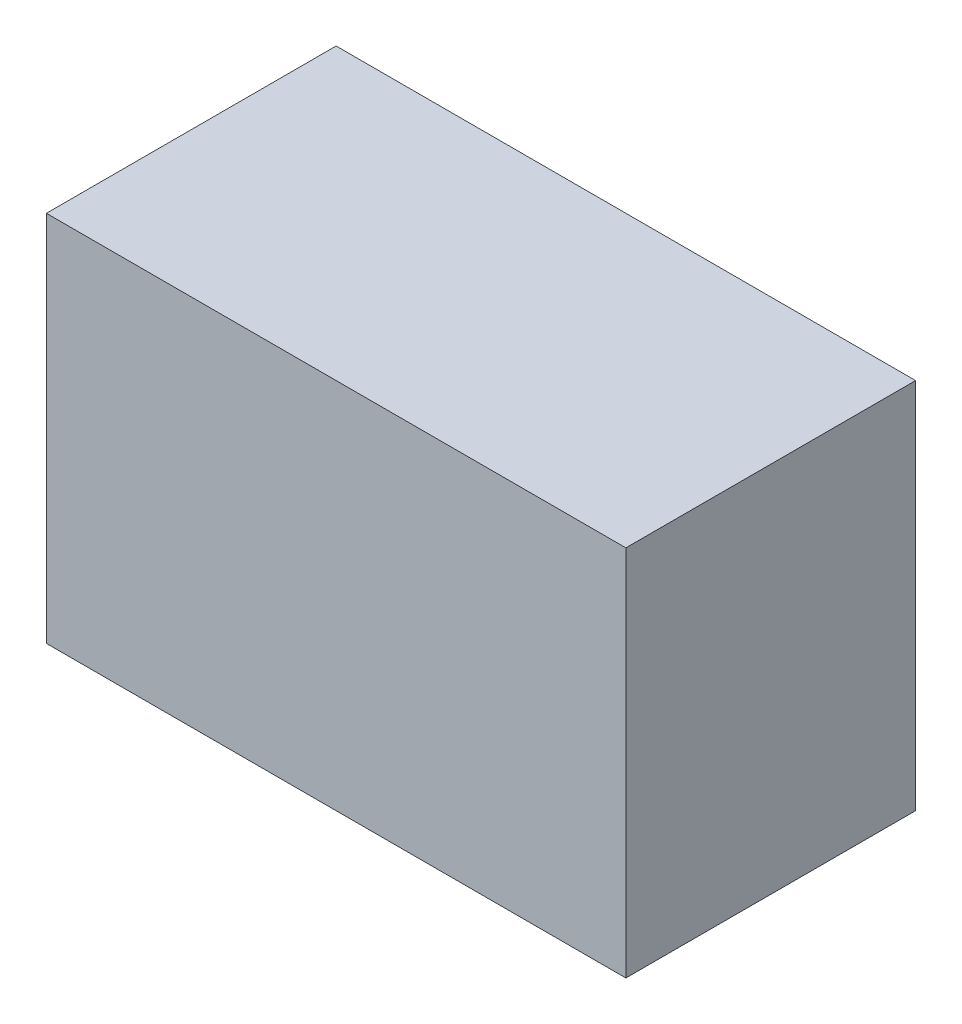
ISO-10303-21;
HEADER;
FILE_DESCRIPTION(('STEP AP214'),'2;1');
FILE_NAME('part.step','',(''),(''),'','','');
FILE_SCHEMA(('AUTOMOTIVE_DESIGN { 1 0 10303 214 1 1 1 1 }'));
ENDSEC;
DATA;
#1=APPLICATION_CONTEXT('core data for automotive mechanical design processes');
#2=APPLICATION_PROTOCOL_DEFINITION('international standard','automotive_design',2000,#1);
#3=PRODUCT_CONTEXT('',#1,'mechanical');
#4=PRODUCT('Part','Part','',(#3));
#5=PRODUCT_RELATED_PRODUCT_CATEGORY('part','',(#4));
#6=PRODUCT_DEFINITION_FORMATION('','',#4);
#7=PRODUCT_DEFINITION_CONTEXT('part definition',#1,'design');
#8=PRODUCT_DEFINITION('design','',#6,#7);
#9=PRODUCT_DEFINITION_SHAPE('','',#8);
#10=(LENGTH_UNIT() NAMED_UNIT(*) SI_UNIT(.MILLI.,.METRE.));
#11=(NAMED_UNIT(*) PLANE_ANGLE_UNIT() SI_UNIT($,.RADIAN.));
#12=(NAMED_UNIT(*) SI_UNIT($,.STERADIAN.) SOLID_ANGLE_UNIT());
#13=UNCERTAINTY_MEASURE_WITH_UNIT(LENGTH_MEASURE(1.E-05),#10,'distance_accuracy_value','');
#14=(GEOMETRIC_REPRESENTATION_CONTEXT(3) GLOBAL_UNCERTAINTY_ASSIGNED_CONTEXT((#13)) GLOBAL_UNIT_ASSIGNED_CONTEXT((#10,
#11,#12)) REPRESENTATION_CONTEXT('',''));
#15=CARTESIAN_POINT('',(0.,0.,0.));
#16=DIRECTION('',(0.,0.,1.));
#17=DIRECTION('',(1.,0.,0.));
#18=AXIS2_PLACEMENT_3D('',#15,#16,#17);
#19=CARTESIAN_POINT('',(-700.,-900.,-350.));
#20=DIRECTION('',(-1.,0.,0.));
#21=DIRECTION('',(0.,0.,1.));
#22=AXIS2_PLACEMENT_3D('',#19,#20,#21);
#23=PLANE('',#22);
#24=DIRECTION('',(0.,0.,1.));
#25=VECTOR('',#24,1.);
#26=CARTESIAN_POINT('',(-700.,0.,-350.));
#27=LINE('',#26,#25);
#28=CARTESIAN_POINT('',(-700.,0.,-350.));
#29=VERTEX_POINT('',#28);
#30=CARTESIAN_POINT('',(-700.,0.,350.));
#31=VERTEX_POINT('',#30);
#32=EDGE_CURVE('E97',#29,#31,#27,.T.);
#33=ORIENTED_EDGE('',*,*,#32,.F.);
#34=DIRECTION('',(0.,1.,0.));
#35=VECTOR('',#34,1.);
#36=CARTESIAN_POINT('',(-700.,-900.,-350.));
#37=LINE('',#36,#35);
#38=CARTESIAN_POINT('',(-700.,-900.,-350.));
#39=VERTEX_POINT('',#38);
#40=EDGE_CURVE('E11',#39,#29,#37,.T.);
#41=ORIENTED_EDGE('',*,*,#40,.F.);
#42=DIRECTION('',(0.,0.,1.));
#43=VECTOR('',#42,1.);
#44=CARTESIAN_POINT('',(-700.,-900.,-350.));
#45=LINE('',#44,#43);
#46=CARTESIAN_POINT('',(-700.,-900.,350.));
#47=VERTEX_POINT('',#46);
#48=EDGE_CURVE('E91',#39,#47,#45,.T.);
#49=ORIENTED_EDGE('',*,*,#48,.T.);
#50=DIRECTION('',(0.,1.,0.));
#51=VECTOR('',#50,1.);
#52=CARTESIAN_POINT('',(-700.,-900.,350.));
#53=LINE('',#52,#51);
#54=EDGE_CURVE('E36',#47,#31,#53,.T.);
#55=ORIENTED_EDGE('',*,*,#54,.T.);
#56=EDGE_LOOP('',(#33,#41,#49,#55));
#57=FACE_BOUND('',#56,.T.);
#58=ADVANCED_FACE('F33',(#57),#23,.T.);
#59=CARTESIAN_POINT('',(-700.,-900.,-350.));
#60=DIRECTION('',(0.,0.,-1.));
#61=DIRECTION('',(-1.,0.,0.));
#62=AXIS2_PLACEMENT_3D('',#59,#60,#61);
#63=PLANE('',#62);
#64=DIRECTION('',(-1.,0.,0.));
#65=VECTOR('',#64,1.);
#66=CARTESIAN_POINT('',(-700.,0.,-350.));
#67=LINE('',#66,#65);
#68=CARTESIAN_POINT('',(700.,0.,-350.));
#69=VERTEX_POINT('',#68);
#70=EDGE_CURVE('E93',#69,#29,#67,.T.);
#71=ORIENTED_EDGE('',*,*,#70,.F.);
#72=DIRECTION('',(0.,1.,0.));
#73=VECTOR('',#72,1.);
#74=CARTESIAN_POINT('',(700.,-900.,-350.));
#75=LINE('',#74,#73);
#76=CARTESIAN_POINT('',(700.,-900.,-350.));
#77=VERTEX_POINT('',#76);
#78=EDGE_CURVE('E42',#77,#69,#75,.T.);
#79=ORIENTED_EDGE('',*,*,#78,.F.);
#80=DIRECTION('',(-1.,0.,0.));
#81=VECTOR('',#80,1.);
#82=CARTESIAN_POINT('',(-700.,-900.,-350.));
#83=LINE('',#82,#81);
#84=EDGE_CURVE('E88',#77,#39,#83,.T.);
#85=ORIENTED_EDGE('',*,*,#84,.T.);
#86=ORIENTED_EDGE('',*,*,#40,.T.);
#87=EDGE_LOOP('',(#71,#79,#85,#86));
#88=FACE_BOUND('',#87,.T.);
#89=ADVANCED_FACE('F107',(#88),#63,.T.);
#90=CARTESIAN_POINT('',(700.,-900.,-350.));
#91=DIRECTION('',(1.,0.,0.));
#92=DIRECTION('',(0.,0.,-1.));
#93=AXIS2_PLACEMENT_3D('',#90,#91,#92);
#94=PLANE('',#93);
#95=DIRECTION('',(0.,0.,-1.));
#96=VECTOR('',#95,1.);
#97=CARTESIAN_POINT('',(700.,0.,-350.));
#98=LINE('',#97,#96);
#99=CARTESIAN_POINT('',(700.,0.,350.));
#100=VERTEX_POINT('',#99);
#101=EDGE_CURVE('E83',#100,#69,#98,.T.);
#102=ORIENTED_EDGE('',*,*,#101,.F.);
#103=DIRECTION('',(0.,1.,0.));
#104=VECTOR('',#103,1.);
#105=CARTESIAN_POINT('',(700.,-900.,350.));
#106=LINE('',#105,#104);
#107=CARTESIAN_POINT('',(700.,-900.,350.));
#108=VERTEX_POINT('',#107);
#109=EDGE_CURVE('E78',#108,#100,#106,.T.);
#110=ORIENTED_EDGE('',*,*,#109,.F.);
#111=DIRECTION('',(0.,0.,-1.));
#112=VECTOR('',#111,1.);
#113=CARTESIAN_POINT('',(700.,-900.,-350.));
#114=LINE('',#113,#112);
#115=EDGE_CURVE('E81',#108,#77,#114,.T.);
#116=ORIENTED_EDGE('',*,*,#115,.T.);
#117=ORIENTED_EDGE('',*,*,#78,.T.);
#118=EDGE_LOOP('',(#102,#110,#116,#117));
#119=FACE_BOUND('',#118,.T.);
#120=ADVANCED_FACE('F80',(#119),#94,.T.);
#121=CARTESIAN_POINT('',(-700.,-900.,350.));
#122=DIRECTION('',(0.,0.,1.));
#123=DIRECTION('',(1.,0.,0.));
#124=AXIS2_PLACEMENT_3D('',#121,#122,#123);
#125=PLANE('',#124);
#126=DIRECTION('',(1.,0.,0.));
#127=VECTOR('',#126,1.);
#128=CARTESIAN_POINT('',(-700.,0.,350.));
#129=LINE('',#128,#127);
#130=EDGE_CURVE('E100',#31,#100,#129,.T.);
#131=ORIENTED_EDGE('',*,*,#130,.F.);
#132=ORIENTED_EDGE('',*,*,#54,.F.);
#133=DIRECTION('',(1.,0.,0.));
#134=VECTOR('',#133,1.);
#135=CARTESIAN_POINT('',(-700.,-900.,350.));
#136=LINE('',#135,#134);
#137=EDGE_CURVE('E87',#47,#108,#136,.T.);
#138=ORIENTED_EDGE('',*,*,#137,.T.);
#139=ORIENTED_EDGE('',*,*,#109,.T.);
#140=EDGE_LOOP('',(#131,#132,#138,#139));
#141=FACE_BOUND('',#140,.T.);
#142=ADVANCED_FACE('F90',(#141),#125,.T.);
#143=CARTESIAN_POINT('',(-700.,-900.,350.));
#144=DIRECTION('',(0.,1.,0.));
#145=DIRECTION('',(0.,0.,1.));
#146=AXIS2_PLACEMENT_3D('',#143,#144,#145);
#147=PLANE('',#146);
#148=ORIENTED_EDGE('',*,*,#48,.F.);
#149=ORIENTED_EDGE('',*,*,#84,.F.);
#150=ORIENTED_EDGE('',*,*,#115,.F.);
#151=ORIENTED_EDGE('',*,*,#137,.F.);
#152=EDGE_LOOP('',(#148,#149,#150,#151));
#153=FACE_BOUND('',#152,.T.);
#154=ADVANCED_FACE('F86',(#153),#147,.F.);
#155=CARTESIAN_POINT('',(-700.,0.,350.));
#156=DIRECTION('',(0.,1.,0.));
#157=DIRECTION('',(0.,0.,1.));
#158=AXIS2_PLACEMENT_3D('',#155,#156,#157);
#159=PLANE('',#158);
#160=ORIENTED_EDGE('',*,*,#32,.T.);
#161=ORIENTED_EDGE('',*,*,#130,.T.);
#162=ORIENTED_EDGE('',*,*,#101,.T.);
#163=ORIENTED_EDGE('',*,*,#70,.T.);
#164=EDGE_LOOP('',(#160,#161,#162,#163));
#165=FACE_BOUND('',#164,.T.);
#166=ADVANCED_FACE('F106',(#165),#159,.T.);
#167=CLOSED_SHELL('',(#58,#89,#120,#142,#154,#166));
#168=MANIFOLD_SOLID_BREP('B2',#167);
#169=ADVANCED_BREP_SHAPE_REPRESENTATION('',(#18,#168),#14);
#170=SHAPE_DEFINITION_REPRESENTATION(#9,#169);
ENDSEC;
END-ISO-10303-21;
